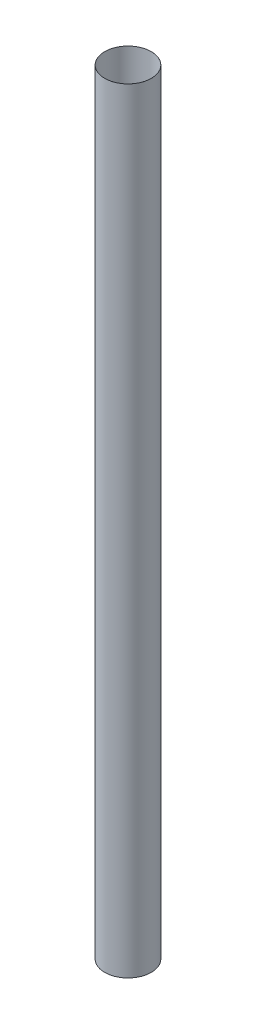
ISO-10303-21;
HEADER;
FILE_DESCRIPTION(('STEP AP214'),'2;1');
FILE_NAME('part.step','',(''),(''),'','','');
FILE_SCHEMA(('AUTOMOTIVE_DESIGN { 1 0 10303 214 1 1 1 1 }'));
ENDSEC;
DATA;
#1=APPLICATION_CONTEXT('core data for automotive mechanical design processes');
#2=APPLICATION_PROTOCOL_DEFINITION('international standard','automotive_design',2000,#1);
#3=PRODUCT_CONTEXT('',#1,'mechanical');
#4=PRODUCT('Part','Part','',(#3));
#5=PRODUCT_RELATED_PRODUCT_CATEGORY('part','',(#4));
#6=PRODUCT_DEFINITION_FORMATION('','',#4);
#7=PRODUCT_DEFINITION_CONTEXT('part definition',#1,'design');
#8=PRODUCT_DEFINITION('design','',#6,#7);
#9=PRODUCT_DEFINITION_SHAPE('','',#8);
#10=(LENGTH_UNIT() NAMED_UNIT(*) SI_UNIT(.MILLI.,.METRE.));
#11=(NAMED_UNIT(*) PLANE_ANGLE_UNIT() SI_UNIT($,.RADIAN.));
#12=(NAMED_UNIT(*) SI_UNIT($,.STERADIAN.) SOLID_ANGLE_UNIT());
#13=UNCERTAINTY_MEASURE_WITH_UNIT(LENGTH_MEASURE(1.E-05),#10,'distance_accuracy_value','');
#14=(GEOMETRIC_REPRESENTATION_CONTEXT(3) GLOBAL_UNCERTAINTY_ASSIGNED_CONTEXT((#13)) GLOBAL_UNIT_ASSIGNED_CONTEXT((#10,
#11,#12)) REPRESENTATION_CONTEXT('',''));
#15=CARTESIAN_POINT('',(0.,0.,0.));
#16=DIRECTION('',(0.,0.,1.));
#17=DIRECTION('',(1.,0.,0.));
#18=AXIS2_PLACEMENT_3D('',#15,#16,#17);
#19=CARTESIAN_POINT('',(0.,1270.,0.));
#20=DIRECTION('',(0.,1.,0.));
#21=DIRECTION('',(0.,0.,1.));
#22=AXIS2_PLACEMENT_3D('',#19,#20,#21);
#23=PLANE('',#22);
#24=CARTESIAN_POINT('',(0.,1270.,0.));
#25=DIRECTION('',(0.,1.,0.));
#26=DIRECTION('',(0.,0.,1.));
#27=AXIS2_PLACEMENT_3D('',#24,#25,#26);
#28=CIRCLE('',#27,38.1254);
#29=CARTESIAN_POINT('',(0.,1270.,38.1254));
#30=VERTEX_POINT('',#29);
#31=EDGE_CURVE('E10',#30,#30,#28,.T.);
#32=ORIENTED_EDGE('',*,*,#31,.T.);
#33=EDGE_LOOP('',(#32));
#34=FACE_BOUND('',#33,.T.);
#35=CARTESIAN_POINT('',(0.,1270.,0.));
#36=DIRECTION('',(0.,1.,0.));
#37=DIRECTION('',(0.,0.,1.));
#38=AXIS2_PLACEMENT_3D('',#35,#36,#37);
#39=CIRCLE('',#38,38.1);
#40=CARTESIAN_POINT('',(0.,1270.,38.1));
#41=VERTEX_POINT('',#40);
#42=EDGE_CURVE('E42',#41,#41,#39,.T.);
#43=ORIENTED_EDGE('',*,*,#42,.F.);
#44=EDGE_LOOP('',(#43));
#45=FACE_BOUND('',#44,.T.);
#46=ADVANCED_FACE('F31',(#34,#45),#23,.T.);
#47=CARTESIAN_POINT('',(0.,0.,0.));
#48=DIRECTION('',(0.,1.,0.));
#49=DIRECTION('',(0.,0.,1.));
#50=AXIS2_PLACEMENT_3D('',#47,#48,#49);
#51=PLANE('',#50);
#52=CARTESIAN_POINT('',(0.,0.,0.));
#53=DIRECTION('',(0.,1.,0.));
#54=DIRECTION('',(0.,0.,1.));
#55=AXIS2_PLACEMENT_3D('',#52,#53,#54);
#56=CIRCLE('',#55,38.1254);
#57=CARTESIAN_POINT('',(0.,0.,38.1254));
#58=VERTEX_POINT('',#57);
#59=EDGE_CURVE('E35',#58,#58,#56,.T.);
#60=ORIENTED_EDGE('',*,*,#59,.F.);
#61=EDGE_LOOP('',(#60));
#62=FACE_BOUND('',#61,.T.);
#63=CARTESIAN_POINT('',(0.,0.,0.));
#64=DIRECTION('',(0.,1.,0.));
#65=DIRECTION('',(0.,0.,1.));
#66=AXIS2_PLACEMENT_3D('',#63,#64,#65);
#67=CIRCLE('',#66,38.1);
#68=CARTESIAN_POINT('',(0.,0.,38.1));
#69=VERTEX_POINT('',#68);
#70=EDGE_CURVE('E44',#69,#69,#67,.T.);
#71=ORIENTED_EDGE('',*,*,#70,.T.);
#72=EDGE_LOOP('',(#71));
#73=FACE_BOUND('',#72,.T.);
#74=ADVANCED_FACE('F54',(#62,#73),#51,.F.);
#75=CARTESIAN_POINT('',(0.,1270.,0.));
#76=DIRECTION('',(0.,-1.,0.));
#77=DIRECTION('',(0.,0.,-1.));
#78=AXIS2_PLACEMENT_3D('',#75,#76,#77);
#79=CYLINDRICAL_SURFACE('',#78,38.1254);
#80=ORIENTED_EDGE('',*,*,#31,.F.);
#81=EDGE_LOOP('',(#80));
#82=FACE_BOUND('',#81,.T.);
#83=ORIENTED_EDGE('',*,*,#59,.T.);
#84=EDGE_LOOP('',(#83));
#85=FACE_BOUND('',#84,.T.);
#86=ADVANCED_FACE('F33',(#82,#85),#79,.T.);
#87=CARTESIAN_POINT('',(0.,1270.,0.));
#88=DIRECTION('',(0.,-1.,0.));
#89=DIRECTION('',(0.,0.,-1.));
#90=AXIS2_PLACEMENT_3D('',#87,#88,#89);
#91=CYLINDRICAL_SURFACE('',#90,38.1);
#92=ORIENTED_EDGE('',*,*,#42,.T.);
#93=EDGE_LOOP('',(#92));
#94=FACE_BOUND('',#93,.T.);
#95=ORIENTED_EDGE('',*,*,#70,.F.);
#96=EDGE_LOOP('',(#95));
#97=FACE_BOUND('',#96,.T.);
#98=ADVANCED_FACE('F50',(#94,#97),#91,.F.);
#99=CLOSED_SHELL('',(#46,#74,#86,#98));
#100=MANIFOLD_SOLID_BREP('B2',#99);
#101=ADVANCED_BREP_SHAPE_REPRESENTATION('',(#18,#100),#14);
#102=SHAPE_DEFINITION_REPRESENTATION(#9,#101);
ENDSEC;
END-ISO-10303-21;
